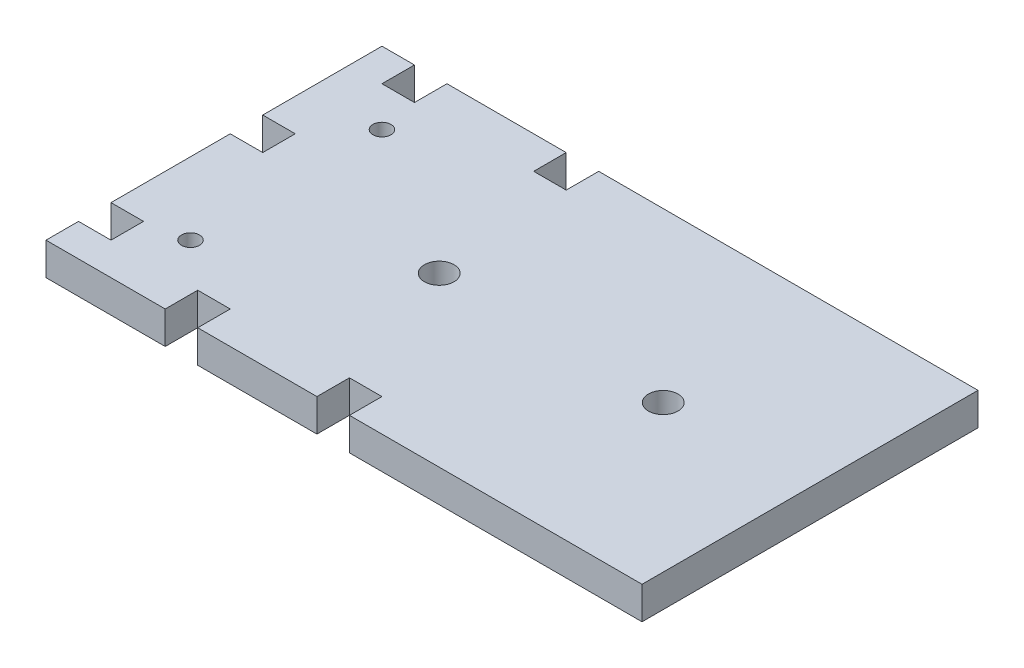
ISO-10303-21;
HEADER;
FILE_DESCRIPTION(('STEP AP214'),'2;1');
FILE_NAME('part.step','',(''),(''),'','','');
FILE_SCHEMA(('AUTOMOTIVE_DESIGN { 1 0 10303 214 1 1 1 1 }'));
ENDSEC;
DATA;
#1=APPLICATION_CONTEXT('core data for automotive mechanical design processes');
#2=APPLICATION_PROTOCOL_DEFINITION('international standard','automotive_design',2000,#1);
#3=PRODUCT_CONTEXT('',#1,'mechanical');
#4=PRODUCT('Part','Part','',(#3));
#5=PRODUCT_RELATED_PRODUCT_CATEGORY('part','',(#4));
#6=PRODUCT_DEFINITION_FORMATION('','',#4);
#7=PRODUCT_DEFINITION_CONTEXT('part definition',#1,'design');
#8=PRODUCT_DEFINITION('design','',#6,#7);
#9=PRODUCT_DEFINITION_SHAPE('','',#8);
#10=(LENGTH_UNIT() NAMED_UNIT(*) SI_UNIT(.MILLI.,.METRE.));
#11=(NAMED_UNIT(*) PLANE_ANGLE_UNIT() SI_UNIT($,.RADIAN.));
#12=(NAMED_UNIT(*) SI_UNIT($,.STERADIAN.) SOLID_ANGLE_UNIT());
#13=UNCERTAINTY_MEASURE_WITH_UNIT(LENGTH_MEASURE(1.E-05),#10,'distance_accuracy_value','');
#14=(GEOMETRIC_REPRESENTATION_CONTEXT(3) GLOBAL_UNCERTAINTY_ASSIGNED_CONTEXT((#13)) GLOBAL_UNIT_ASSIGNED_CONTEXT((#10,
#11,#12)) REPRESENTATION_CONTEXT('',''));
#15=CARTESIAN_POINT('',(0.,0.,0.));
#16=DIRECTION('',(0.,0.,1.));
#17=DIRECTION('',(1.,0.,0.));
#18=AXIS2_PLACEMENT_3D('',#15,#16,#17);
#19=CARTESIAN_POINT('',(-41.25,4.5,-23.25));
#20=DIRECTION('',(0.,0.,1.));
#21=DIRECTION('',(1.,0.,0.));
#22=AXIS2_PLACEMENT_3D('',#19,#20,#21);
#23=PLANE('',#22);
#24=DIRECTION('',(-1.,0.,0.));
#25=VECTOR('',#24,1.);
#26=CARTESIAN_POINT('',(-41.25,4.5,-23.25));
#27=LINE('',#26,#25);
#28=CARTESIAN_POINT('',(-15.75,4.5,-23.25));
#29=VERTEX_POINT('',#28);
#30=CARTESIAN_POINT('',(-32.25,4.5,-23.25));
#31=VERTEX_POINT('',#30);
#32=EDGE_CURVE('E234',#29,#31,#27,.T.);
#33=ORIENTED_EDGE('',*,*,#32,.F.);
#34=DIRECTION('',(0.,-1.,0.));
#35=VECTOR('',#34,1.);
#36=CARTESIAN_POINT('',(-15.75,4.5,-23.25));
#37=LINE('',#36,#35);
#38=CARTESIAN_POINT('',(-15.75,0.,-23.25));
#39=VERTEX_POINT('',#38);
#40=EDGE_CURVE('E217',#29,#39,#37,.T.);
#41=ORIENTED_EDGE('',*,*,#40,.T.);
#42=DIRECTION('',(-1.,0.,0.));
#43=VECTOR('',#42,1.);
#44=CARTESIAN_POINT('',(-41.25,0.,-23.25));
#45=LINE('',#44,#43);
#46=CARTESIAN_POINT('',(-32.25,0.,-23.25));
#47=VERTEX_POINT('',#46);
#48=EDGE_CURVE('E270',#39,#47,#45,.T.);
#49=ORIENTED_EDGE('',*,*,#48,.T.);
#50=DIRECTION('',(0.,-1.,0.));
#51=VECTOR('',#50,1.);
#52=CARTESIAN_POINT('',(-32.25,4.5,-23.25));
#53=LINE('',#52,#51);
#54=EDGE_CURVE('E241',#31,#47,#53,.T.);
#55=ORIENTED_EDGE('',*,*,#54,.F.);
#56=EDGE_LOOP('',(#33,#41,#49,#55));
#57=FACE_BOUND('',#56,.T.);
#58=ADVANCED_FACE('F32',(#57),#23,.F.);
#59=CARTESIAN_POINT('',(-41.25,4.5,23.25));
#60=DIRECTION('',(0.,0.,-1.));
#61=DIRECTION('',(-1.,0.,0.));
#62=AXIS2_PLACEMENT_3D('',#59,#60,#61);
#63=PLANE('',#62);
#64=DIRECTION('',(1.,0.,0.));
#65=VECTOR('',#64,1.);
#66=CARTESIAN_POINT('',(-41.25,0.,23.25));
#67=LINE('',#66,#65);
#68=CARTESIAN_POINT('',(-20.25,0.,23.25));
#69=VERTEX_POINT('',#68);
#70=CARTESIAN_POINT('',(-3.75000000000001,0.,23.25));
#71=VERTEX_POINT('',#70);
#72=EDGE_CURVE('E279',#69,#71,#67,.T.);
#73=ORIENTED_EDGE('',*,*,#72,.T.);
#74=DIRECTION('',(0.,-1.,0.));
#75=VECTOR('',#74,1.);
#76=CARTESIAN_POINT('',(-3.75000000000001,4.5,23.25));
#77=LINE('',#76,#75);
#78=CARTESIAN_POINT('',(-3.75000000000001,4.5,23.25));
#79=VERTEX_POINT('',#78);
#80=EDGE_CURVE('E447',#79,#71,#77,.T.);
#81=ORIENTED_EDGE('',*,*,#80,.F.);
#82=DIRECTION('',(1.,0.,0.));
#83=VECTOR('',#82,1.);
#84=CARTESIAN_POINT('',(-41.25,4.5,23.25));
#85=LINE('',#84,#83);
#86=CARTESIAN_POINT('',(-20.25,4.5,23.25));
#87=VERTEX_POINT('',#86);
#88=EDGE_CURVE('E260',#87,#79,#85,.T.);
#89=ORIENTED_EDGE('',*,*,#88,.F.);
#90=DIRECTION('',(0.,-1.,0.));
#91=VECTOR('',#90,1.);
#92=CARTESIAN_POINT('',(-20.25,4.5,23.25));
#93=LINE('',#92,#91);
#94=EDGE_CURVE('E475',#87,#69,#93,.T.);
#95=ORIENTED_EDGE('',*,*,#94,.T.);
#96=EDGE_LOOP('',(#73,#81,#89,#95));
#97=FACE_BOUND('',#96,.T.);
#98=ADVANCED_FACE('F391',(#97),#63,.F.);
#99=CARTESIAN_POINT('',(-41.25,0.,23.25));
#100=VERTEX_POINT('',#99);
#101=CARTESIAN_POINT('',(-24.75,0.,23.25));
#102=VERTEX_POINT('',#101);
#103=EDGE_CURVE('E276',#100,#102,#67,.T.);
#104=ORIENTED_EDGE('',*,*,#103,.T.);
#105=DIRECTION('',(0.,-1.,0.));
#106=VECTOR('',#105,1.);
#107=CARTESIAN_POINT('',(-24.75,4.5,23.25));
#108=LINE('',#107,#106);
#109=CARTESIAN_POINT('',(-24.75,4.5,23.25));
#110=VERTEX_POINT('',#109);
#111=EDGE_CURVE('E472',#110,#102,#108,.T.);
#112=ORIENTED_EDGE('',*,*,#111,.F.);
#113=CARTESIAN_POINT('',(-41.25,4.5,23.25));
#114=VERTEX_POINT('',#113);
#115=EDGE_CURVE('E256',#114,#110,#85,.T.);
#116=ORIENTED_EDGE('',*,*,#115,.F.);
#117=DIRECTION('',(0.,-1.,0.));
#118=VECTOR('',#117,1.);
#119=CARTESIAN_POINT('',(-41.25,4.5,23.25));
#120=LINE('',#119,#118);
#121=EDGE_CURVE('E282',#114,#100,#120,.T.);
#122=ORIENTED_EDGE('',*,*,#121,.T.);
#123=EDGE_LOOP('',(#104,#112,#116,#122));
#124=FACE_BOUND('',#123,.T.);
#125=ADVANCED_FACE('F392',(#124),#63,.F.);
#126=CARTESIAN_POINT('',(-41.25,4.5,-23.25));
#127=DIRECTION('',(1.,0.,0.));
#128=DIRECTION('',(0.,0.,-1.));
#129=AXIS2_PLACEMENT_3D('',#126,#127,#128);
#130=PLANE('',#129);
#131=DIRECTION('',(0.,0.,1.));
#132=VECTOR('',#131,1.);
#133=CARTESIAN_POINT('',(-41.25,4.5,-23.25));
#134=LINE('',#133,#132);
#135=CARTESIAN_POINT('',(-41.25,4.5,18.75));
#136=VERTEX_POINT('',#135);
#137=EDGE_CURVE('E246',#136,#114,#134,.T.);
#138=ORIENTED_EDGE('',*,*,#137,.F.);
#139=DIRECTION('',(0.,-1.,0.));
#140=VECTOR('',#139,1.);
#141=CARTESIAN_POINT('',(-41.25,4.5,18.75));
#142=LINE('',#141,#140);
#143=CARTESIAN_POINT('',(-41.25,0.,18.75));
#144=VERTEX_POINT('',#143);
#145=EDGE_CURVE('E306',#136,#144,#142,.T.);
#146=ORIENTED_EDGE('',*,*,#145,.T.);
#147=DIRECTION('',(0.,0.,1.));
#148=VECTOR('',#147,1.);
#149=CARTESIAN_POINT('',(-41.25,0.,-23.25));
#150=LINE('',#149,#148);
#151=EDGE_CURVE('E269',#144,#100,#150,.T.);
#152=ORIENTED_EDGE('',*,*,#151,.T.);
#153=ORIENTED_EDGE('',*,*,#121,.F.);
#154=EDGE_LOOP('',(#138,#146,#152,#153));
#155=FACE_BOUND('',#154,.T.);
#156=ADVANCED_FACE('F410',(#155),#130,.F.);
#157=CARTESIAN_POINT('',(-41.25,0.,-2.25));
#158=VERTEX_POINT('',#157);
#159=CARTESIAN_POINT('',(-41.25,0.,14.25));
#160=VERTEX_POINT('',#159);
#161=EDGE_CURVE('E275',#158,#160,#150,.T.);
#162=ORIENTED_EDGE('',*,*,#161,.T.);
#163=DIRECTION('',(0.,-1.,0.));
#164=VECTOR('',#163,1.);
#165=CARTESIAN_POINT('',(-41.25,4.5,14.25));
#166=LINE('',#165,#164);
#167=CARTESIAN_POINT('',(-41.25,4.5,14.25));
#168=VERTEX_POINT('',#167);
#169=EDGE_CURVE('E491',#168,#160,#166,.T.);
#170=ORIENTED_EDGE('',*,*,#169,.F.);
#171=CARTESIAN_POINT('',(-41.25,4.5,-2.25));
#172=VERTEX_POINT('',#171);
#173=EDGE_CURVE('E255',#172,#168,#134,.T.);
#174=ORIENTED_EDGE('',*,*,#173,.F.);
#175=DIRECTION('',(0.,-1.,0.));
#176=VECTOR('',#175,1.);
#177=CARTESIAN_POINT('',(-41.25,4.5,-2.25));
#178=LINE('',#177,#176);
#179=EDGE_CURVE('E319',#172,#158,#178,.T.);
#180=ORIENTED_EDGE('',*,*,#179,.T.);
#181=EDGE_LOOP('',(#162,#170,#174,#180));
#182=FACE_BOUND('',#181,.T.);
#183=ADVANCED_FACE('F403',(#182),#130,.F.);
#184=CARTESIAN_POINT('',(-36.75,4.5,-23.25));
#185=VERTEX_POINT('',#184);
#186=CARTESIAN_POINT('',(-41.25,4.5,-23.25));
#187=VERTEX_POINT('',#186);
#188=EDGE_CURVE('E243',#185,#187,#27,.T.);
#189=ORIENTED_EDGE('',*,*,#188,.F.);
#190=DIRECTION('',(0.,-1.,0.));
#191=VECTOR('',#190,1.);
#192=CARTESIAN_POINT('',(-36.75,4.5,-23.25));
#193=LINE('',#192,#191);
#194=CARTESIAN_POINT('',(-36.75,0.,-23.25));
#195=VERTEX_POINT('',#194);
#196=EDGE_CURVE('E338',#185,#195,#193,.T.);
#197=ORIENTED_EDGE('',*,*,#196,.T.);
#198=CARTESIAN_POINT('',(-41.25,0.,-23.25));
#199=VERTEX_POINT('',#198);
#200=EDGE_CURVE('E264',#195,#199,#45,.T.);
#201=ORIENTED_EDGE('',*,*,#200,.T.);
#202=DIRECTION('',(0.,-1.,0.));
#203=VECTOR('',#202,1.);
#204=CARTESIAN_POINT('',(-41.25,4.5,-23.25));
#205=LINE('',#204,#203);
#206=EDGE_CURVE('E40',#187,#199,#205,.T.);
#207=ORIENTED_EDGE('',*,*,#206,.F.);
#208=EDGE_LOOP('',(#189,#197,#201,#207));
#209=FACE_BOUND('',#208,.T.);
#210=ADVANCED_FACE('F395',(#209),#23,.F.);
#211=CARTESIAN_POINT('',(0.,4.5,0.));
#212=DIRECTION('',(0.,1.,0.));
#213=DIRECTION('',(0.,0.,1.));
#214=AXIS2_PLACEMENT_3D('',#211,#212,#213);
#215=PLANE('',#214);
#216=DIRECTION('',(0.,0.,-1.));
#217=VECTOR('',#216,1.);
#218=CARTESIAN_POINT('',(-15.75,4.5,-23.25));
#219=LINE('',#218,#217);
#220=CARTESIAN_POINT('',(-15.75,4.5,-18.75));
#221=VERTEX_POINT('',#220);
#222=EDGE_CURVE('E220',#221,#29,#219,.T.);
#223=ORIENTED_EDGE('',*,*,#222,.T.);
#224=ORIENTED_EDGE('',*,*,#32,.T.);
#225=DIRECTION('',(0.,0.,1.));
#226=VECTOR('',#225,1.);
#227=CARTESIAN_POINT('',(-32.25,4.5,-23.25));
#228=LINE('',#227,#226);
#229=CARTESIAN_POINT('',(-32.25,4.5,-18.75));
#230=VERTEX_POINT('',#229);
#231=EDGE_CURVE('E332',#31,#230,#228,.T.);
#232=ORIENTED_EDGE('',*,*,#231,.T.);
#233=DIRECTION('',(-1.,0.,0.));
#234=VECTOR('',#233,1.);
#235=CARTESIAN_POINT('',(-36.75,4.5,-18.75));
#236=LINE('',#235,#234);
#237=CARTESIAN_POINT('',(-36.75,4.5,-18.75));
#238=VERTEX_POINT('',#237);
#239=EDGE_CURVE('E335',#230,#238,#236,.T.);
#240=ORIENTED_EDGE('',*,*,#239,.T.);
#241=DIRECTION('',(0.,0.,-1.));
#242=VECTOR('',#241,1.);
#243=CARTESIAN_POINT('',(-36.75,4.5,-23.25));
#244=LINE('',#243,#242);
#245=EDGE_CURVE('E329',#238,#185,#244,.T.);
#246=ORIENTED_EDGE('',*,*,#245,.T.);
#247=ORIENTED_EDGE('',*,*,#188,.T.);
#248=CARTESIAN_POINT('',(-41.25,4.5,-6.75));
#249=VERTEX_POINT('',#248);
#250=EDGE_CURVE('E251',#187,#249,#134,.T.);
#251=ORIENTED_EDGE('',*,*,#250,.T.);
#252=DIRECTION('',(1.,0.,0.));
#253=VECTOR('',#252,1.);
#254=CARTESIAN_POINT('',(-41.25,4.5,-6.75));
#255=LINE('',#254,#253);
#256=CARTESIAN_POINT('',(-36.75,4.5,-6.74999999999999));
#257=VERTEX_POINT('',#256);
#258=EDGE_CURVE('E318',#249,#257,#255,.T.);
#259=ORIENTED_EDGE('',*,*,#258,.T.);
#260=DIRECTION('',(0.,0.,1.));
#261=VECTOR('',#260,1.);
#262=CARTESIAN_POINT('',(-36.75,4.5,-6.74999999999999));
#263=LINE('',#262,#261);
#264=CARTESIAN_POINT('',(-36.75,4.5,-2.24999999999999));
#265=VERTEX_POINT('',#264);
#266=EDGE_CURVE('E503',#257,#265,#263,.T.);
#267=ORIENTED_EDGE('',*,*,#266,.T.);
#268=DIRECTION('',(-1.,0.,0.));
#269=VECTOR('',#268,1.);
#270=CARTESIAN_POINT('',(-41.25,4.5,-2.25));
#271=LINE('',#270,#269);
#272=EDGE_CURVE('E314',#265,#172,#271,.T.);
#273=ORIENTED_EDGE('',*,*,#272,.T.);
#274=ORIENTED_EDGE('',*,*,#173,.T.);
#275=DIRECTION('',(1.,0.,0.));
#276=VECTOR('',#275,1.);
#277=CARTESIAN_POINT('',(-41.25,4.5,14.25));
#278=LINE('',#277,#276);
#279=CARTESIAN_POINT('',(-36.75,4.5,14.25));
#280=VERTEX_POINT('',#279);
#281=EDGE_CURVE('E481',#168,#280,#278,.T.);
#282=ORIENTED_EDGE('',*,*,#281,.T.);
#283=DIRECTION('',(0.,0.,1.));
#284=VECTOR('',#283,1.);
#285=CARTESIAN_POINT('',(-36.75,4.5,14.25));
#286=LINE('',#285,#284);
#287=CARTESIAN_POINT('',(-36.75,4.5,18.75));
#288=VERTEX_POINT('',#287);
#289=EDGE_CURVE('E484',#280,#288,#286,.T.);
#290=ORIENTED_EDGE('',*,*,#289,.T.);
#291=DIRECTION('',(-1.,0.,0.));
#292=VECTOR('',#291,1.);
#293=CARTESIAN_POINT('',(-41.25,4.5,18.75));
#294=LINE('',#293,#292);
#295=EDGE_CURVE('E488',#288,#136,#294,.T.);
#296=ORIENTED_EDGE('',*,*,#295,.T.);
#297=ORIENTED_EDGE('',*,*,#137,.T.);
#298=ORIENTED_EDGE('',*,*,#115,.T.);
#299=DIRECTION('',(0.,0.,-1.));
#300=VECTOR('',#299,1.);
#301=CARTESIAN_POINT('',(-24.75,4.5,23.25));
#302=LINE('',#301,#300);
#303=CARTESIAN_POINT('',(-24.75,4.5,18.75));
#304=VERTEX_POINT('',#303);
#305=EDGE_CURVE('E455',#110,#304,#302,.T.);
#306=ORIENTED_EDGE('',*,*,#305,.T.);
#307=DIRECTION('',(1.,0.,0.));
#308=VECTOR('',#307,1.);
#309=CARTESIAN_POINT('',(-24.75,4.5,18.75));
#310=LINE('',#309,#308);
#311=CARTESIAN_POINT('',(-20.25,4.5,18.75));
#312=VERTEX_POINT('',#311);
#313=EDGE_CURVE('E458',#304,#312,#310,.T.);
#314=ORIENTED_EDGE('',*,*,#313,.T.);
#315=DIRECTION('',(0.,0.,1.));
#316=VECTOR('',#315,1.);
#317=CARTESIAN_POINT('',(-20.25,4.5,23.25));
#318=LINE('',#317,#316);
#319=EDGE_CURVE('E462',#312,#87,#318,.T.);
#320=ORIENTED_EDGE('',*,*,#319,.T.);
#321=ORIENTED_EDGE('',*,*,#88,.T.);
#322=DIRECTION('',(0.,0.,-1.));
#323=VECTOR('',#322,1.);
#324=CARTESIAN_POINT('',(-3.75000000000001,4.5,23.25));
#325=LINE('',#324,#323);
#326=CARTESIAN_POINT('',(-3.75000000000001,4.5,18.75));
#327=VERTEX_POINT('',#326);
#328=EDGE_CURVE('E431',#79,#327,#325,.T.);
#329=ORIENTED_EDGE('',*,*,#328,.T.);
#330=DIRECTION('',(1.,0.,0.));
#331=VECTOR('',#330,1.);
#332=CARTESIAN_POINT('',(-3.75000000000001,4.5,18.75));
#333=LINE('',#332,#331);
#334=CARTESIAN_POINT('',(0.749999999999993,4.5,18.75));
#335=VERTEX_POINT('',#334);
#336=EDGE_CURVE('E434',#327,#335,#333,.T.);
#337=ORIENTED_EDGE('',*,*,#336,.T.);
#338=DIRECTION('',(0.,0.,1.));
#339=VECTOR('',#338,1.);
#340=CARTESIAN_POINT('',(0.749999999999993,4.5,23.25));
#341=LINE('',#340,#339);
#342=CARTESIAN_POINT('',(0.749999999999993,4.5,23.25));
#343=VERTEX_POINT('',#342);
#344=EDGE_CURVE('E437',#335,#343,#341,.T.);
#345=ORIENTED_EDGE('',*,*,#344,.T.);
#346=CARTESIAN_POINT('',(41.25,4.5,23.25));
#347=VERTEX_POINT('',#346);
#348=EDGE_CURVE('E254',#343,#347,#85,.T.);
#349=ORIENTED_EDGE('',*,*,#348,.T.);
#350=DIRECTION('',(0.,0.,-1.));
#351=VECTOR('',#350,1.);
#352=CARTESIAN_POINT('',(41.25,4.5,-23.25));
#353=LINE('',#352,#351);
#354=CARTESIAN_POINT('',(41.25,4.5,-23.25));
#355=VERTEX_POINT('',#354);
#356=EDGE_CURVE('E247',#347,#355,#353,.T.);
#357=ORIENTED_EDGE('',*,*,#356,.T.);
#358=CARTESIAN_POINT('',(-11.25,4.5,-23.25));
#359=VERTEX_POINT('',#358);
#360=EDGE_CURVE('E242',#355,#359,#27,.T.);
#361=ORIENTED_EDGE('',*,*,#360,.T.);
#362=DIRECTION('',(0.,0.,1.));
#363=VECTOR('',#362,1.);
#364=CARTESIAN_POINT('',(-11.25,4.5,-23.25));
#365=LINE('',#364,#363);
#366=CARTESIAN_POINT('',(-11.25,4.5,-18.75));
#367=VERTEX_POINT('',#366);
#368=EDGE_CURVE('E47',#359,#367,#365,.T.);
#369=ORIENTED_EDGE('',*,*,#368,.T.);
#370=DIRECTION('',(-1.,0.,0.));
#371=VECTOR('',#370,1.);
#372=CARTESIAN_POINT('',(-15.75,4.5,-18.75));
#373=LINE('',#372,#371);
#374=EDGE_CURVE('E228',#367,#221,#373,.T.);
#375=ORIENTED_EDGE('',*,*,#374,.T.);
#376=EDGE_LOOP('',(#223,#224,#232,#240,#246,#247,#251,#259,#267,#273,#274,#282,#290,#296,#297,
#298,#306,#314,#320,#321,#329,#337,#345,#349,#357,#361,#369,#375));
#377=FACE_BOUND('',#376,.T.);
#378=CARTESIAN_POINT('',(-31.25,4.5,-13.25));
#379=DIRECTION('',(0.,1.,0.));
#380=DIRECTION('',(0.,0.,1.));
#381=AXIS2_PLACEMENT_3D('',#378,#379,#380);
#382=CIRCLE('',#381,1.25);
#383=CARTESIAN_POINT('',(-31.25,4.5,-12.));
#384=VERTEX_POINT('',#383);
#385=EDGE_CURVE('E347',#384,#384,#382,.T.);
#386=ORIENTED_EDGE('',*,*,#385,.F.);
#387=EDGE_LOOP('',(#386));
#388=FACE_BOUND('',#387,.T.);
#389=CARTESIAN_POINT('',(-31.25,4.5,13.25));
#390=DIRECTION('',(0.,1.,0.));
#391=DIRECTION('',(0.,0.,1.));
#392=AXIS2_PLACEMENT_3D('',#389,#390,#391);
#393=CIRCLE('',#392,1.25);
#394=CARTESIAN_POINT('',(-31.25,4.5,14.5));
#395=VERTEX_POINT('',#394);
#396=EDGE_CURVE('E356',#395,#395,#393,.T.);
#397=ORIENTED_EDGE('',*,*,#396,.F.);
#398=EDGE_LOOP('',(#397));
#399=FACE_BOUND('',#398,.T.);
#400=CARTESIAN_POINT('',(20.92918,4.5,0.));
#401=DIRECTION('',(0.,1.,0.));
#402=DIRECTION('',(0.,0.,1.));
#403=AXIS2_PLACEMENT_3D('',#400,#401,#402);
#404=CIRCLE('',#403,2.05);
#405=CARTESIAN_POINT('',(20.92918,4.5,2.05));
#406=VERTEX_POINT('',#405);
#407=EDGE_CURVE('E265',#406,#406,#404,.T.);
#408=ORIENTED_EDGE('',*,*,#407,.F.);
#409=EDGE_LOOP('',(#408));
#410=FACE_BOUND('',#409,.T.);
#411=CARTESIAN_POINT('',(-10.07082,4.5,0.));
#412=DIRECTION('',(0.,1.,0.));
#413=DIRECTION('',(0.,0.,1.));
#414=AXIS2_PLACEMENT_3D('',#411,#412,#413);
#415=CIRCLE('',#414,2.05);
#416=CARTESIAN_POINT('',(-10.07082,4.5,2.05));
#417=VERTEX_POINT('',#416);
#418=EDGE_CURVE('E365',#417,#417,#415,.T.);
#419=ORIENTED_EDGE('',*,*,#418,.F.);
#420=EDGE_LOOP('',(#419));
#421=FACE_BOUND('',#420,.T.);
#422=ADVANCED_FACE('F231',(#377,#388,#399,#410,#421),#215,.T.);
#423=CARTESIAN_POINT('',(0.,0.,0.));
#424=DIRECTION('',(0.,1.,0.));
#425=DIRECTION('',(0.,0.,1.));
#426=AXIS2_PLACEMENT_3D('',#423,#424,#425);
#427=PLANE('',#426);
#428=CARTESIAN_POINT('',(-31.25,0.,-13.25));
#429=DIRECTION('',(0.,1.,0.));
#430=DIRECTION('',(0.,0.,1.));
#431=AXIS2_PLACEMENT_3D('',#428,#429,#430);
#432=CIRCLE('',#431,1.25);
#433=CARTESIAN_POINT('',(-31.25,0.,-12.));
#434=VERTEX_POINT('',#433);
#435=EDGE_CURVE('E353',#434,#434,#432,.T.);
#436=ORIENTED_EDGE('',*,*,#435,.T.);
#437=EDGE_LOOP('',(#436));
#438=FACE_BOUND('',#437,.T.);
#439=CARTESIAN_POINT('',(-31.25,0.,13.25));
#440=DIRECTION('',(0.,1.,0.));
#441=DIRECTION('',(0.,0.,1.));
#442=AXIS2_PLACEMENT_3D('',#439,#440,#441);
#443=CIRCLE('',#442,1.25);
#444=CARTESIAN_POINT('',(-31.25,0.,14.5));
#445=VERTEX_POINT('',#444);
#446=EDGE_CURVE('E359',#445,#445,#443,.T.);
#447=ORIENTED_EDGE('',*,*,#446,.T.);
#448=EDGE_LOOP('',(#447));
#449=FACE_BOUND('',#448,.T.);
#450=CARTESIAN_POINT('',(20.92918,0.,0.));
#451=DIRECTION('',(0.,1.,0.));
#452=DIRECTION('',(0.,0.,1.));
#453=AXIS2_PLACEMENT_3D('',#450,#451,#452);
#454=CIRCLE('',#453,2.05);
#455=CARTESIAN_POINT('',(20.92918,0.,2.05));
#456=VERTEX_POINT('',#455);
#457=EDGE_CURVE('E368',#456,#456,#454,.T.);
#458=ORIENTED_EDGE('',*,*,#457,.T.);
#459=EDGE_LOOP('',(#458));
#460=FACE_BOUND('',#459,.T.);
#461=ORIENTED_EDGE('',*,*,#48,.F.);
#462=DIRECTION('',(0.,0.,-1.));
#463=VECTOR('',#462,1.);
#464=CARTESIAN_POINT('',(-15.75,0.,-23.25));
#465=LINE('',#464,#463);
#466=CARTESIAN_POINT('',(-15.75,0.,-18.75));
#467=VERTEX_POINT('',#466);
#468=EDGE_CURVE('E223',#467,#39,#465,.T.);
#469=ORIENTED_EDGE('',*,*,#468,.F.);
#470=DIRECTION('',(-1.,0.,0.));
#471=VECTOR('',#470,1.);
#472=CARTESIAN_POINT('',(-15.75,0.,-18.75));
#473=LINE('',#472,#471);
#474=CARTESIAN_POINT('',(-11.25,0.,-18.75));
#475=VERTEX_POINT('',#474);
#476=EDGE_CURVE('E237',#475,#467,#473,.T.);
#477=ORIENTED_EDGE('',*,*,#476,.F.);
#478=DIRECTION('',(0.,0.,1.));
#479=VECTOR('',#478,1.);
#480=CARTESIAN_POINT('',(-11.25,0.,-23.25));
#481=LINE('',#480,#479);
#482=CARTESIAN_POINT('',(-11.25,0.,-23.25));
#483=VERTEX_POINT('',#482);
#484=EDGE_CURVE('E418',#483,#475,#481,.T.);
#485=ORIENTED_EDGE('',*,*,#484,.F.);
#486=CARTESIAN_POINT('',(41.25,0.,-23.25));
#487=VERTEX_POINT('',#486);
#488=EDGE_CURVE('E266',#487,#483,#45,.T.);
#489=ORIENTED_EDGE('',*,*,#488,.F.);
#490=DIRECTION('',(0.,0.,-1.));
#491=VECTOR('',#490,1.);
#492=CARTESIAN_POINT('',(41.25,0.,-23.25));
#493=LINE('',#492,#491);
#494=CARTESIAN_POINT('',(41.25,0.,23.25));
#495=VERTEX_POINT('',#494);
#496=EDGE_CURVE('E261',#495,#487,#493,.T.);
#497=ORIENTED_EDGE('',*,*,#496,.F.);
#498=CARTESIAN_POINT('',(0.749999999999994,0.,23.25));
#499=VERTEX_POINT('',#498);
#500=EDGE_CURVE('E274',#499,#495,#67,.T.);
#501=ORIENTED_EDGE('',*,*,#500,.F.);
#502=DIRECTION('',(0.,0.,1.));
#503=VECTOR('',#502,1.);
#504=CARTESIAN_POINT('',(0.749999999999993,0.,23.25));
#505=LINE('',#504,#503);
#506=CARTESIAN_POINT('',(0.749999999999993,0.,18.75));
#507=VERTEX_POINT('',#506);
#508=EDGE_CURVE('E55',#507,#499,#505,.T.);
#509=ORIENTED_EDGE('',*,*,#508,.F.);
#510=DIRECTION('',(1.,0.,0.));
#511=VECTOR('',#510,1.);
#512=CARTESIAN_POINT('',(-3.75000000000001,0.,18.75));
#513=LINE('',#512,#511);
#514=CARTESIAN_POINT('',(-3.75000000000001,0.,18.75));
#515=VERTEX_POINT('',#514);
#516=EDGE_CURVE('E443',#515,#507,#513,.T.);
#517=ORIENTED_EDGE('',*,*,#516,.F.);
#518=DIRECTION('',(0.,0.,-1.));
#519=VECTOR('',#518,1.);
#520=CARTESIAN_POINT('',(-3.75000000000001,0.,23.25));
#521=LINE('',#520,#519);
#522=EDGE_CURVE('E427',#71,#515,#521,.T.);
#523=ORIENTED_EDGE('',*,*,#522,.F.);
#524=ORIENTED_EDGE('',*,*,#72,.F.);
#525=DIRECTION('',(0.,0.,1.));
#526=VECTOR('',#525,1.);
#527=CARTESIAN_POINT('',(-20.25,0.,23.25));
#528=LINE('',#527,#526);
#529=CARTESIAN_POINT('',(-20.25,0.,18.75));
#530=VERTEX_POINT('',#529);
#531=EDGE_CURVE('E459',#530,#69,#528,.T.);
#532=ORIENTED_EDGE('',*,*,#531,.F.);
#533=DIRECTION('',(1.,0.,0.));
#534=VECTOR('',#533,1.);
#535=CARTESIAN_POINT('',(-24.75,0.,18.75));
#536=LINE('',#535,#534);
#537=CARTESIAN_POINT('',(-24.75,0.,18.75));
#538=VERTEX_POINT('',#537);
#539=EDGE_CURVE('E468',#538,#530,#536,.T.);
#540=ORIENTED_EDGE('',*,*,#539,.F.);
#541=DIRECTION('',(0.,0.,-1.));
#542=VECTOR('',#541,1.);
#543=CARTESIAN_POINT('',(-24.75,0.,23.25));
#544=LINE('',#543,#542);
#545=EDGE_CURVE('E449',#102,#538,#544,.T.);
#546=ORIENTED_EDGE('',*,*,#545,.F.);
#547=ORIENTED_EDGE('',*,*,#103,.F.);
#548=ORIENTED_EDGE('',*,*,#151,.F.);
#549=DIRECTION('',(-1.,0.,0.));
#550=VECTOR('',#549,1.);
#551=CARTESIAN_POINT('',(-41.25,0.,18.75));
#552=LINE('',#551,#550);
#553=CARTESIAN_POINT('',(-36.75,0.,18.75));
#554=VERTEX_POINT('',#553);
#555=EDGE_CURVE('E485',#554,#144,#552,.T.);
#556=ORIENTED_EDGE('',*,*,#555,.F.);
#557=DIRECTION('',(0.,0.,1.));
#558=VECTOR('',#557,1.);
#559=CARTESIAN_POINT('',(-36.75,0.,14.25));
#560=LINE('',#559,#558);
#561=CARTESIAN_POINT('',(-36.75,0.,14.25));
#562=VERTEX_POINT('',#561);
#563=EDGE_CURVE('E494',#562,#554,#560,.T.);
#564=ORIENTED_EDGE('',*,*,#563,.F.);
#565=DIRECTION('',(1.,0.,0.));
#566=VECTOR('',#565,1.);
#567=CARTESIAN_POINT('',(-41.25,0.,14.25));
#568=LINE('',#567,#566);
#569=EDGE_CURVE('E474',#160,#562,#568,.T.);
#570=ORIENTED_EDGE('',*,*,#569,.F.);
#571=ORIENTED_EDGE('',*,*,#161,.F.);
#572=DIRECTION('',(-1.,0.,0.));
#573=VECTOR('',#572,1.);
#574=CARTESIAN_POINT('',(-41.25,0.,-2.25));
#575=LINE('',#574,#573);
#576=CARTESIAN_POINT('',(-36.75,0.,-2.24999999999999));
#577=VERTEX_POINT('',#576);
#578=EDGE_CURVE('E308',#577,#158,#575,.T.);
#579=ORIENTED_EDGE('',*,*,#578,.F.);
#580=DIRECTION('',(0.,0.,1.));
#581=VECTOR('',#580,1.);
#582=CARTESIAN_POINT('',(-36.75,0.,-6.74999999999999));
#583=LINE('',#582,#581);
#584=CARTESIAN_POINT('',(-36.75,0.,-6.74999999999999));
#585=VERTEX_POINT('',#584);
#586=EDGE_CURVE('E304',#585,#577,#583,.T.);
#587=ORIENTED_EDGE('',*,*,#586,.F.);
#588=DIRECTION('',(1.,0.,0.));
#589=VECTOR('',#588,1.);
#590=CARTESIAN_POINT('',(-41.25,0.,-6.75));
#591=LINE('',#590,#589);
#592=CARTESIAN_POINT('',(-41.25,0.,-6.75));
#593=VERTEX_POINT('',#592);
#594=EDGE_CURVE('E301',#593,#585,#591,.T.);
#595=ORIENTED_EDGE('',*,*,#594,.F.);
#596=EDGE_CURVE('E271',#199,#593,#150,.T.);
#597=ORIENTED_EDGE('',*,*,#596,.F.);
#598=ORIENTED_EDGE('',*,*,#200,.F.);
#599=DIRECTION('',(0.,0.,-1.));
#600=VECTOR('',#599,1.);
#601=CARTESIAN_POINT('',(-36.75,0.,-23.25));
#602=LINE('',#601,#600);
#603=CARTESIAN_POINT('',(-36.75,0.,-18.75));
#604=VERTEX_POINT('',#603);
#605=EDGE_CURVE('E322',#604,#195,#602,.T.);
#606=ORIENTED_EDGE('',*,*,#605,.F.);
#607=DIRECTION('',(-1.,0.,0.));
#608=VECTOR('',#607,1.);
#609=CARTESIAN_POINT('',(-36.75,0.,-18.75));
#610=LINE('',#609,#608);
#611=CARTESIAN_POINT('',(-32.25,0.,-18.75));
#612=VERTEX_POINT('',#611);
#613=EDGE_CURVE('E333',#612,#604,#610,.T.);
#614=ORIENTED_EDGE('',*,*,#613,.F.);
#615=DIRECTION('',(0.,0.,1.));
#616=VECTOR('',#615,1.);
#617=CARTESIAN_POINT('',(-32.25,0.,-23.25));
#618=LINE('',#617,#616);
#619=EDGE_CURVE('E340',#47,#612,#618,.T.);
#620=ORIENTED_EDGE('',*,*,#619,.F.);
#621=EDGE_LOOP('',(#461,#469,#477,#485,#489,#497,#501,#509,#517,#523,#524,#532,#540,#546,#547,
#548,#556,#564,#570,#571,#579,#587,#595,#597,#598,#606,#614,#620));
#622=FACE_BOUND('',#621,.T.);
#623=CARTESIAN_POINT('',(-10.07082,0.,0.));
#624=DIRECTION('',(0.,1.,0.));
#625=DIRECTION('',(0.,0.,1.));
#626=AXIS2_PLACEMENT_3D('',#623,#624,#625);
#627=CIRCLE('',#626,2.05);
#628=CARTESIAN_POINT('',(-10.07082,0.,2.05));
#629=VERTEX_POINT('',#628);
#630=EDGE_CURVE('E362',#629,#629,#627,.T.);
#631=ORIENTED_EDGE('',*,*,#630,.T.);
#632=EDGE_LOOP('',(#631));
#633=FACE_BOUND('',#632,.T.);
#634=ADVANCED_FACE('F296',(#438,#449,#460,#622,#633),#427,.F.);
#635=CARTESIAN_POINT('',(41.25,4.5,-23.25));
#636=DIRECTION('',(-1.,0.,0.));
#637=DIRECTION('',(0.,0.,1.));
#638=AXIS2_PLACEMENT_3D('',#635,#636,#637);
#639=PLANE('',#638);
#640=ORIENTED_EDGE('',*,*,#496,.T.);
#641=DIRECTION('',(0.,-1.,0.));
#642=VECTOR('',#641,1.);
#643=CARTESIAN_POINT('',(41.25,4.5,-23.25));
#644=LINE('',#643,#642);
#645=EDGE_CURVE('E11',#355,#487,#644,.T.);
#646=ORIENTED_EDGE('',*,*,#645,.F.);
#647=ORIENTED_EDGE('',*,*,#356,.F.);
#648=DIRECTION('',(0.,-1.,0.));
#649=VECTOR('',#648,1.);
#650=CARTESIAN_POINT('',(41.25,4.5,23.25));
#651=LINE('',#650,#649);
#652=EDGE_CURVE('E259',#347,#495,#651,.T.);
#653=ORIENTED_EDGE('',*,*,#652,.T.);
#654=EDGE_LOOP('',(#640,#646,#647,#653));
#655=FACE_BOUND('',#654,.T.);
#656=ADVANCED_FACE('F34',(#655),#639,.F.);
#657=ORIENTED_EDGE('',*,*,#488,.T.);
#658=DIRECTION('',(0.,-1.,0.));
#659=VECTOR('',#658,1.);
#660=CARTESIAN_POINT('',(-11.25,4.5,-23.25));
#661=LINE('',#660,#659);
#662=EDGE_CURVE('E227',#359,#483,#661,.T.);
#663=ORIENTED_EDGE('',*,*,#662,.F.);
#664=ORIENTED_EDGE('',*,*,#360,.F.);
#665=ORIENTED_EDGE('',*,*,#645,.T.);
#666=EDGE_LOOP('',(#657,#663,#664,#665));
#667=FACE_BOUND('',#666,.T.);
#668=ADVANCED_FACE('F396',(#667),#23,.F.);
#669=ORIENTED_EDGE('',*,*,#596,.T.);
#670=DIRECTION('',(0.,-1.,0.));
#671=VECTOR('',#670,1.);
#672=CARTESIAN_POINT('',(-41.25,4.5,-6.75));
#673=LINE('',#672,#671);
#674=EDGE_CURVE('E327',#249,#593,#673,.T.);
#675=ORIENTED_EDGE('',*,*,#674,.F.);
#676=ORIENTED_EDGE('',*,*,#250,.F.);
#677=ORIENTED_EDGE('',*,*,#206,.T.);
#678=EDGE_LOOP('',(#669,#675,#676,#677));
#679=FACE_BOUND('',#678,.T.);
#680=ADVANCED_FACE('F289',(#679),#130,.F.);
#681=ORIENTED_EDGE('',*,*,#348,.F.);
#682=DIRECTION('',(0.,-1.,0.));
#683=VECTOR('',#682,1.);
#684=CARTESIAN_POINT('',(0.749999999999993,4.5,23.25));
#685=LINE('',#684,#683);
#686=EDGE_CURVE('E450',#343,#499,#685,.T.);
#687=ORIENTED_EDGE('',*,*,#686,.T.);
#688=ORIENTED_EDGE('',*,*,#500,.T.);
#689=ORIENTED_EDGE('',*,*,#652,.F.);
#690=EDGE_LOOP('',(#681,#687,#688,#689));
#691=FACE_BOUND('',#690,.T.);
#692=ADVANCED_FACE('F379',(#691),#63,.F.);
#693=CARTESIAN_POINT('',(20.92918,4.5,0.));
#694=DIRECTION('',(0.,-1.,0.));
#695=DIRECTION('',(0.,0.,-1.));
#696=AXIS2_PLACEMENT_3D('',#693,#694,#695);
#697=CYLINDRICAL_SURFACE('',#696,2.05);
#698=ORIENTED_EDGE('',*,*,#407,.T.);
#699=EDGE_LOOP('',(#698));
#700=FACE_BOUND('',#699,.T.);
#701=ORIENTED_EDGE('',*,*,#457,.F.);
#702=EDGE_LOOP('',(#701));
#703=FACE_BOUND('',#702,.T.);
#704=ADVANCED_FACE('F376',(#700,#703),#697,.F.);
#705=CARTESIAN_POINT('',(-10.07082,4.5,0.));
#706=DIRECTION('',(0.,-1.,0.));
#707=DIRECTION('',(0.,0.,-1.));
#708=AXIS2_PLACEMENT_3D('',#705,#706,#707);
#709=CYLINDRICAL_SURFACE('',#708,2.05);
#710=ORIENTED_EDGE('',*,*,#418,.T.);
#711=EDGE_LOOP('',(#710));
#712=FACE_BOUND('',#711,.T.);
#713=ORIENTED_EDGE('',*,*,#630,.F.);
#714=EDGE_LOOP('',(#713));
#715=FACE_BOUND('',#714,.T.);
#716=ADVANCED_FACE('F378',(#712,#715),#709,.F.);
#717=CARTESIAN_POINT('',(-31.25,0.,13.25));
#718=DIRECTION('',(0.,1.,0.));
#719=DIRECTION('',(0.,0.,1.));
#720=AXIS2_PLACEMENT_3D('',#717,#718,#719);
#721=CYLINDRICAL_SURFACE('',#720,1.25);
#722=ORIENTED_EDGE('',*,*,#446,.F.);
#723=EDGE_LOOP('',(#722));
#724=FACE_BOUND('',#723,.T.);
#725=ORIENTED_EDGE('',*,*,#396,.T.);
#726=EDGE_LOOP('',(#725));
#727=FACE_BOUND('',#726,.T.);
#728=ADVANCED_FACE('F386',(#724,#727),#721,.F.);
#729=CARTESIAN_POINT('',(-31.25,0.,-13.25));
#730=DIRECTION('',(0.,1.,0.));
#731=DIRECTION('',(0.,0.,1.));
#732=AXIS2_PLACEMENT_3D('',#729,#730,#731);
#733=CYLINDRICAL_SURFACE('',#732,1.25);
#734=ORIENTED_EDGE('',*,*,#435,.F.);
#735=EDGE_LOOP('',(#734));
#736=FACE_BOUND('',#735,.T.);
#737=ORIENTED_EDGE('',*,*,#385,.T.);
#738=EDGE_LOOP('',(#737));
#739=FACE_BOUND('',#738,.T.);
#740=ADVANCED_FACE('F603',(#736,#739),#733,.F.);
#741=CARTESIAN_POINT('',(-36.75,4.5,-23.25));
#742=DIRECTION('',(-1.,0.,0.));
#743=DIRECTION('',(0.,0.,1.));
#744=AXIS2_PLACEMENT_3D('',#741,#742,#743);
#745=PLANE('',#744);
#746=ORIENTED_EDGE('',*,*,#605,.T.);
#747=ORIENTED_EDGE('',*,*,#196,.F.);
#748=ORIENTED_EDGE('',*,*,#245,.F.);
#749=DIRECTION('',(0.,-1.,0.));
#750=VECTOR('',#749,1.);
#751=CARTESIAN_POINT('',(-36.75,4.5,-18.75));
#752=LINE('',#751,#750);
#753=EDGE_CURVE('E345',#238,#604,#752,.T.);
#754=ORIENTED_EDGE('',*,*,#753,.T.);
#755=EDGE_LOOP('',(#746,#747,#748,#754));
#756=FACE_BOUND('',#755,.T.);
#757=ADVANCED_FACE('F596',(#756),#745,.F.);
#758=CARTESIAN_POINT('',(-36.75,4.5,-18.75));
#759=DIRECTION('',(0.,0.,1.));
#760=DIRECTION('',(1.,0.,0.));
#761=AXIS2_PLACEMENT_3D('',#758,#759,#760);
#762=PLANE('',#761);
#763=ORIENTED_EDGE('',*,*,#613,.T.);
#764=ORIENTED_EDGE('',*,*,#753,.F.);
#765=ORIENTED_EDGE('',*,*,#239,.F.);
#766=DIRECTION('',(0.,-1.,0.));
#767=VECTOR('',#766,1.);
#768=CARTESIAN_POINT('',(-32.25,4.5,-18.75));
#769=LINE('',#768,#767);
#770=EDGE_CURVE('E348',#230,#612,#769,.T.);
#771=ORIENTED_EDGE('',*,*,#770,.T.);
#772=EDGE_LOOP('',(#763,#764,#765,#771));
#773=FACE_BOUND('',#772,.T.);
#774=ADVANCED_FACE('F593',(#773),#762,.F.);
#775=CARTESIAN_POINT('',(-32.25,4.5,-23.25));
#776=DIRECTION('',(1.,0.,0.));
#777=DIRECTION('',(0.,0.,-1.));
#778=AXIS2_PLACEMENT_3D('',#775,#776,#777);
#779=PLANE('',#778);
#780=ORIENTED_EDGE('',*,*,#619,.T.);
#781=ORIENTED_EDGE('',*,*,#770,.F.);
#782=ORIENTED_EDGE('',*,*,#231,.F.);
#783=ORIENTED_EDGE('',*,*,#54,.T.);
#784=EDGE_LOOP('',(#780,#781,#782,#783));
#785=FACE_BOUND('',#784,.T.);
#786=ADVANCED_FACE('F587',(#785),#779,.F.);
#787=CARTESIAN_POINT('',(-41.25,4.5,-2.25));
#788=DIRECTION('',(0.,0.,1.));
#789=DIRECTION('',(1.,0.,0.));
#790=AXIS2_PLACEMENT_3D('',#787,#788,#789);
#791=PLANE('',#790);
#792=ORIENTED_EDGE('',*,*,#578,.T.);
#793=ORIENTED_EDGE('',*,*,#179,.F.);
#794=ORIENTED_EDGE('',*,*,#272,.F.);
#795=DIRECTION('',(0.,-1.,0.));
#796=VECTOR('',#795,1.);
#797=CARTESIAN_POINT('',(-36.75,4.5,-2.24999999999999));
#798=LINE('',#797,#796);
#799=EDGE_CURVE('E323',#265,#577,#798,.T.);
#800=ORIENTED_EDGE('',*,*,#799,.T.);
#801=EDGE_LOOP('',(#792,#793,#794,#800));
#802=FACE_BOUND('',#801,.T.);
#803=ADVANCED_FACE('F583',(#802),#791,.F.);
#804=CARTESIAN_POINT('',(-36.75,4.5,-6.74999999999999));
#805=DIRECTION('',(1.,0.,0.));
#806=DIRECTION('',(0.,0.,-1.));
#807=AXIS2_PLACEMENT_3D('',#804,#805,#806);
#808=PLANE('',#807);
#809=ORIENTED_EDGE('',*,*,#586,.T.);
#810=ORIENTED_EDGE('',*,*,#799,.F.);
#811=ORIENTED_EDGE('',*,*,#266,.F.);
#812=DIRECTION('',(0.,-1.,0.));
#813=VECTOR('',#812,1.);
#814=CARTESIAN_POINT('',(-36.75,4.5,-6.74999999999999));
#815=LINE('',#814,#813);
#816=EDGE_CURVE('E325',#257,#585,#815,.T.);
#817=ORIENTED_EDGE('',*,*,#816,.T.);
#818=EDGE_LOOP('',(#809,#810,#811,#817));
#819=FACE_BOUND('',#818,.T.);
#820=ADVANCED_FACE('F586',(#819),#808,.F.);
#821=CARTESIAN_POINT('',(-41.25,4.5,-6.75));
#822=DIRECTION('',(0.,0.,-1.));
#823=DIRECTION('',(-1.,0.,0.));
#824=AXIS2_PLACEMENT_3D('',#821,#822,#823);
#825=PLANE('',#824);
#826=ORIENTED_EDGE('',*,*,#594,.T.);
#827=ORIENTED_EDGE('',*,*,#816,.F.);
#828=ORIENTED_EDGE('',*,*,#258,.F.);
#829=ORIENTED_EDGE('',*,*,#674,.T.);
#830=EDGE_LOOP('',(#826,#827,#828,#829));
#831=FACE_BOUND('',#830,.T.);
#832=ADVANCED_FACE('F575',(#831),#825,.F.);
#833=CARTESIAN_POINT('',(-41.25,4.5,18.75));
#834=DIRECTION('',(0.,0.,1.));
#835=DIRECTION('',(1.,0.,0.));
#836=AXIS2_PLACEMENT_3D('',#833,#834,#835);
#837=PLANE('',#836);
#838=ORIENTED_EDGE('',*,*,#555,.T.);
#839=ORIENTED_EDGE('',*,*,#145,.F.);
#840=ORIENTED_EDGE('',*,*,#295,.F.);
#841=DIRECTION('',(0.,-1.,0.));
#842=VECTOR('',#841,1.);
#843=CARTESIAN_POINT('',(-36.75,4.5,18.75));
#844=LINE('',#843,#842);
#845=EDGE_CURVE('E311',#288,#554,#844,.T.);
#846=ORIENTED_EDGE('',*,*,#845,.T.);
#847=EDGE_LOOP('',(#838,#839,#840,#846));
#848=FACE_BOUND('',#847,.T.);
#849=ADVANCED_FACE('F571',(#848),#837,.F.);
#850=CARTESIAN_POINT('',(-36.75,4.5,14.25));
#851=DIRECTION('',(1.,0.,0.));
#852=DIRECTION('',(0.,0.,-1.));
#853=AXIS2_PLACEMENT_3D('',#850,#851,#852);
#854=PLANE('',#853);
#855=ORIENTED_EDGE('',*,*,#563,.T.);
#856=ORIENTED_EDGE('',*,*,#845,.F.);
#857=ORIENTED_EDGE('',*,*,#289,.F.);
#858=DIRECTION('',(0.,-1.,0.));
#859=VECTOR('',#858,1.);
#860=CARTESIAN_POINT('',(-36.75,4.5,14.25));
#861=LINE('',#860,#859);
#862=EDGE_CURVE('E499',#280,#562,#861,.T.);
#863=ORIENTED_EDGE('',*,*,#862,.T.);
#864=EDGE_LOOP('',(#855,#856,#857,#863));
#865=FACE_BOUND('',#864,.T.);
#866=ADVANCED_FACE('F574',(#865),#854,.F.);
#867=CARTESIAN_POINT('',(-41.25,4.5,14.25));
#868=DIRECTION('',(0.,0.,-1.));
#869=DIRECTION('',(-1.,0.,0.));
#870=AXIS2_PLACEMENT_3D('',#867,#868,#869);
#871=PLANE('',#870);
#872=ORIENTED_EDGE('',*,*,#569,.T.);
#873=ORIENTED_EDGE('',*,*,#862,.F.);
#874=ORIENTED_EDGE('',*,*,#281,.F.);
#875=ORIENTED_EDGE('',*,*,#169,.T.);
#876=EDGE_LOOP('',(#872,#873,#874,#875));
#877=FACE_BOUND('',#876,.T.);
#878=ADVANCED_FACE('F570',(#877),#871,.F.);
#879=CARTESIAN_POINT('',(-24.75,4.5,23.25));
#880=DIRECTION('',(-1.,0.,0.));
#881=DIRECTION('',(0.,0.,1.));
#882=AXIS2_PLACEMENT_3D('',#879,#880,#881);
#883=PLANE('',#882);
#884=ORIENTED_EDGE('',*,*,#545,.T.);
#885=DIRECTION('',(0.,-1.,0.));
#886=VECTOR('',#885,1.);
#887=CARTESIAN_POINT('',(-24.75,4.5,18.75));
#888=LINE('',#887,#886);
#889=EDGE_CURVE('E465',#304,#538,#888,.T.);
#890=ORIENTED_EDGE('',*,*,#889,.F.);
#891=ORIENTED_EDGE('',*,*,#305,.F.);
#892=ORIENTED_EDGE('',*,*,#111,.T.);
#893=EDGE_LOOP('',(#884,#890,#891,#892));
#894=FACE_BOUND('',#893,.T.);
#895=ADVANCED_FACE('F526',(#894),#883,.F.);
#896=CARTESIAN_POINT('',(-20.25,4.5,23.25));
#897=DIRECTION('',(1.,0.,0.));
#898=DIRECTION('',(0.,0.,-1.));
#899=AXIS2_PLACEMENT_3D('',#896,#897,#898);
#900=PLANE('',#899);
#901=ORIENTED_EDGE('',*,*,#531,.T.);
#902=ORIENTED_EDGE('',*,*,#94,.F.);
#903=ORIENTED_EDGE('',*,*,#319,.F.);
#904=DIRECTION('',(0.,-1.,0.));
#905=VECTOR('',#904,1.);
#906=CARTESIAN_POINT('',(-20.25,4.5,18.75));
#907=LINE('',#906,#905);
#908=EDGE_CURVE('E478',#312,#530,#907,.T.);
#909=ORIENTED_EDGE('',*,*,#908,.T.);
#910=EDGE_LOOP('',(#901,#902,#903,#909));
#911=FACE_BOUND('',#910,.T.);
#912=ADVANCED_FACE('F563',(#911),#900,.F.);
#913=CARTESIAN_POINT('',(-24.75,4.5,18.75));
#914=DIRECTION('',(0.,0.,-1.));
#915=DIRECTION('',(-1.,0.,0.));
#916=AXIS2_PLACEMENT_3D('',#913,#914,#915);
#917=PLANE('',#916);
#918=ORIENTED_EDGE('',*,*,#539,.T.);
#919=ORIENTED_EDGE('',*,*,#908,.F.);
#920=ORIENTED_EDGE('',*,*,#313,.F.);
#921=ORIENTED_EDGE('',*,*,#889,.T.);
#922=EDGE_LOOP('',(#918,#919,#920,#921));
#923=FACE_BOUND('',#922,.T.);
#924=ADVANCED_FACE('F531',(#923),#917,.F.);
#925=CARTESIAN_POINT('',(-3.75000000000001,4.5,23.25));
#926=DIRECTION('',(-1.,0.,0.));
#927=DIRECTION('',(0.,0.,1.));
#928=AXIS2_PLACEMENT_3D('',#925,#926,#927);
#929=PLANE('',#928);
#930=ORIENTED_EDGE('',*,*,#522,.T.);
#931=DIRECTION('',(0.,-1.,0.));
#932=VECTOR('',#931,1.);
#933=CARTESIAN_POINT('',(-3.75000000000001,4.5,18.75));
#934=LINE('',#933,#932);
#935=EDGE_CURVE('E440',#327,#515,#934,.T.);
#936=ORIENTED_EDGE('',*,*,#935,.F.);
#937=ORIENTED_EDGE('',*,*,#328,.F.);
#938=ORIENTED_EDGE('',*,*,#80,.T.);
#939=EDGE_LOOP('',(#930,#936,#937,#938));
#940=FACE_BOUND('',#939,.T.);
#941=ADVANCED_FACE('F547',(#940),#929,.F.);
#942=CARTESIAN_POINT('',(0.749999999999993,4.5,23.25));
#943=DIRECTION('',(1.,0.,0.));
#944=DIRECTION('',(0.,0.,-1.));
#945=AXIS2_PLACEMENT_3D('',#942,#943,#944);
#946=PLANE('',#945);
#947=ORIENTED_EDGE('',*,*,#508,.T.);
#948=ORIENTED_EDGE('',*,*,#686,.F.);
#949=ORIENTED_EDGE('',*,*,#344,.F.);
#950=DIRECTION('',(0.,-1.,0.));
#951=VECTOR('',#950,1.);
#952=CARTESIAN_POINT('',(0.749999999999993,4.5,18.75));
#953=LINE('',#952,#951);
#954=EDGE_CURVE('E452',#335,#507,#953,.T.);
#955=ORIENTED_EDGE('',*,*,#954,.T.);
#956=EDGE_LOOP('',(#947,#948,#949,#955));
#957=FACE_BOUND('',#956,.T.);
#958=ADVANCED_FACE('F551',(#957),#946,.F.);
#959=CARTESIAN_POINT('',(-3.75000000000001,4.5,18.75));
#960=DIRECTION('',(0.,0.,-1.));
#961=DIRECTION('',(-1.,0.,0.));
#962=AXIS2_PLACEMENT_3D('',#959,#960,#961);
#963=PLANE('',#962);
#964=ORIENTED_EDGE('',*,*,#516,.T.);
#965=ORIENTED_EDGE('',*,*,#954,.F.);
#966=ORIENTED_EDGE('',*,*,#336,.F.);
#967=ORIENTED_EDGE('',*,*,#935,.T.);
#968=EDGE_LOOP('',(#964,#965,#966,#967));
#969=FACE_BOUND('',#968,.T.);
#970=ADVANCED_FACE('F550',(#969),#963,.F.);
#971=CARTESIAN_POINT('',(-15.75,4.5,-23.25));
#972=DIRECTION('',(-1.,0.,0.));
#973=DIRECTION('',(0.,0.,1.));
#974=AXIS2_PLACEMENT_3D('',#971,#972,#973);
#975=PLANE('',#974);
#976=ORIENTED_EDGE('',*,*,#468,.T.);
#977=ORIENTED_EDGE('',*,*,#40,.F.);
#978=ORIENTED_EDGE('',*,*,#222,.F.);
#979=DIRECTION('',(0.,-1.,0.));
#980=VECTOR('',#979,1.);
#981=CARTESIAN_POINT('',(-15.75,4.5,-18.75));
#982=LINE('',#981,#980);
#983=EDGE_CURVE('E425',#221,#467,#982,.T.);
#984=ORIENTED_EDGE('',*,*,#983,.T.);
#985=EDGE_LOOP('',(#976,#977,#978,#984));
#986=FACE_BOUND('',#985,.T.);
#987=ADVANCED_FACE('F219',(#986),#975,.F.);
#988=CARTESIAN_POINT('',(-15.75,4.5,-18.75));
#989=DIRECTION('',(0.,0.,1.));
#990=DIRECTION('',(1.,0.,0.));
#991=AXIS2_PLACEMENT_3D('',#988,#989,#990);
#992=PLANE('',#991);
#993=ORIENTED_EDGE('',*,*,#476,.T.);
#994=ORIENTED_EDGE('',*,*,#983,.F.);
#995=ORIENTED_EDGE('',*,*,#374,.F.);
#996=DIRECTION('',(0.,-1.,0.));
#997=VECTOR('',#996,1.);
#998=CARTESIAN_POINT('',(-11.25,4.5,-18.75));
#999=LINE('',#998,#997);
#1000=EDGE_CURVE('E428',#367,#475,#999,.T.);
#1001=ORIENTED_EDGE('',*,*,#1000,.T.);
#1002=EDGE_LOOP('',(#993,#994,#995,#1001));
#1003=FACE_BOUND('',#1002,.T.);
#1004=ADVANCED_FACE('F788',(#1003),#992,.F.);
#1005=CARTESIAN_POINT('',(-11.25,4.5,-23.25));
#1006=DIRECTION('',(1.,0.,0.));
#1007=DIRECTION('',(0.,0.,-1.));
#1008=AXIS2_PLACEMENT_3D('',#1005,#1006,#1007);
#1009=PLANE('',#1008);
#1010=ORIENTED_EDGE('',*,*,#484,.T.);
#1011=ORIENTED_EDGE('',*,*,#1000,.F.);
#1012=ORIENTED_EDGE('',*,*,#368,.F.);
#1013=ORIENTED_EDGE('',*,*,#662,.T.);
#1014=EDGE_LOOP('',(#1010,#1011,#1012,#1013));
#1015=FACE_BOUND('',#1014,.T.);
#1016=ADVANCED_FACE('F795',(#1015),#1009,.F.);
#1017=CLOSED_SHELL('',(#58,#98,#125,#156,#183,#210,#422,#634,#656,#668,#680,#692,#704,#716,#728,
#740,#757,#774,#786,#803,#820,#832,#849,#866,#878,#895,#912,#924,#941,#958,#970,#987,#1004,#1016));
#1018=MANIFOLD_SOLID_BREP('B2',#1017);
#1019=ADVANCED_BREP_SHAPE_REPRESENTATION('',(#18,#1018),#14);
#1020=SHAPE_DEFINITION_REPRESENTATION(#9,#1019);
ENDSEC;
END-ISO-10303-21;
